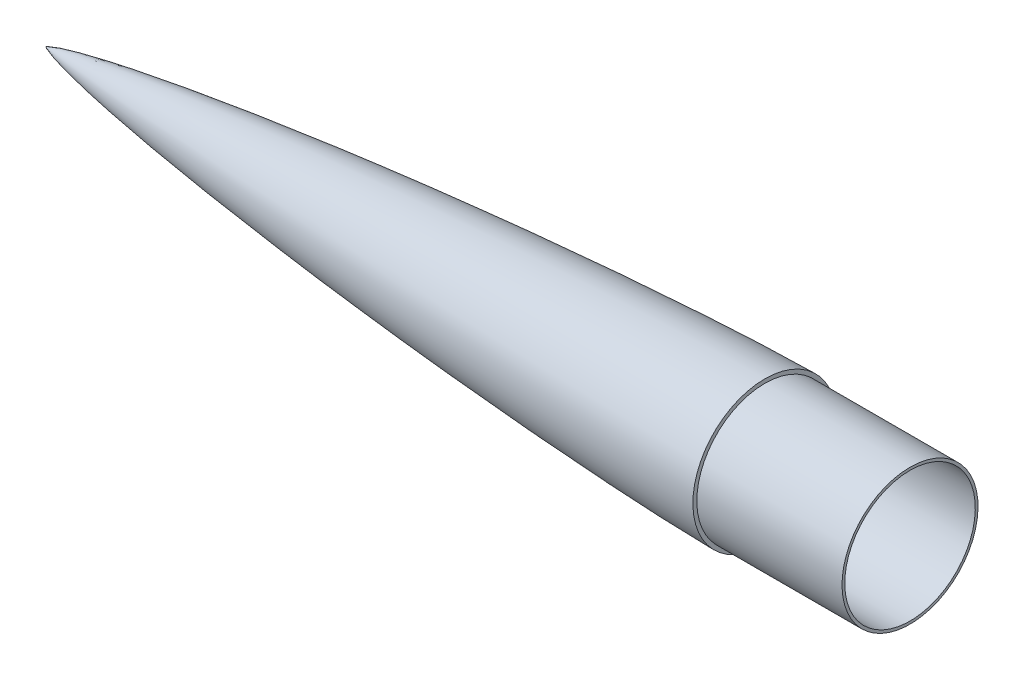
ISO-10303-21;
HEADER;
FILE_DESCRIPTION(('STEP AP214'),'2;1');
FILE_NAME('part.step','',(''),(''),'','','');
FILE_SCHEMA(('AUTOMOTIVE_DESIGN { 1 0 10303 214 1 1 1 1 }'));
ENDSEC;
DATA;
#1=APPLICATION_CONTEXT('core data for automotive mechanical design processes');
#2=APPLICATION_PROTOCOL_DEFINITION('international standard','automotive_design',2000,#1);
#3=PRODUCT_CONTEXT('',#1,'mechanical');
#4=PRODUCT('Part','Part','',(#3));
#5=PRODUCT_RELATED_PRODUCT_CATEGORY('part','',(#4));
#6=PRODUCT_DEFINITION_FORMATION('','',#4);
#7=PRODUCT_DEFINITION_CONTEXT('part definition',#1,'design');
#8=PRODUCT_DEFINITION('design','',#6,#7);
#9=PRODUCT_DEFINITION_SHAPE('','',#8);
#10=(LENGTH_UNIT() NAMED_UNIT(*) SI_UNIT(.MILLI.,.METRE.));
#11=(NAMED_UNIT(*) PLANE_ANGLE_UNIT() SI_UNIT($,.RADIAN.));
#12=(NAMED_UNIT(*) SI_UNIT($,.STERADIAN.) SOLID_ANGLE_UNIT());
#13=UNCERTAINTY_MEASURE_WITH_UNIT(LENGTH_MEASURE(1.E-05),#10,'distance_accuracy_value','');
#14=(GEOMETRIC_REPRESENTATION_CONTEXT(3) GLOBAL_UNCERTAINTY_ASSIGNED_CONTEXT((#13)) GLOBAL_UNIT_ASSIGNED_CONTEXT((#10,
#11,#12)) REPRESENTATION_CONTEXT('',''));
#15=CARTESIAN_POINT('',(0.,0.,0.));
#16=DIRECTION('',(0.,0.,1.));
#17=DIRECTION('',(1.,0.,0.));
#18=AXIS2_PLACEMENT_3D('',#15,#16,#17);
#19=CARTESIAN_POINT('',(-476.,0.,0.));
#20=CARTESIAN_POINT('',(-475.999922920819,0.000860537285582133,0.));
#21=CARTESIAN_POINT('',(-475.991878272098,0.0192033740595545,0.));
#22=CARTESIAN_POINT('',(-475.965540019143,0.0488864114918146,0.));
#23=CARTESIAN_POINT('',(-475.880792523819,0.123460292077126,0.));
#24=CARTESIAN_POINT('',(-475.734454887747,0.21905444991268,0.));
#25=CARTESIAN_POINT('',(-475.487969376193,0.357045715282055,0.));
#26=CARTESIAN_POINT('',(-474.946410800452,0.615798145596084,0.));
#27=CARTESIAN_POINT('',(-473.65161712361,1.12979349487069,0.));
#28=CARTESIAN_POINT('',(-471.290217834756,1.88750510020403,0.));
#29=CARTESIAN_POINT('',(-467.913404675593,2.80855324353986,0.));
#30=CARTESIAN_POINT('',(-463.57646866607,3.85126433139292,0.));
#31=CARTESIAN_POINT('',(-458.79875295069,4.89613203429191,0.));
#32=CARTESIAN_POINT('',(-452.589553113043,6.15603189866401,0.));
#33=CARTESIAN_POINT('',(-444.698966636829,7.63096789135536,0.));
#34=CARTESIAN_POINT('',(-435.267626095885,9.25753951763064,0.));
#35=CARTESIAN_POINT('',(-421.488450855965,11.4584031076222,0.));
#36=CARTESIAN_POINT('',(-404.627471311696,13.9261565228831,0.));
#37=CARTESIAN_POINT('',(-384.923327777814,16.5691784085527,0.));
#38=CARTESIAN_POINT('',(-362.372449264854,19.3405007994015,0.));
#39=CARTESIAN_POINT('',(-339.797340005275,21.9058954693206,0.));
#40=CARTESIAN_POINT('',(-317.202600233706,24.2917857189304,0.));
#41=CARTESIAN_POINT('',(-294.59135497595,26.5153367887988,0.));
#42=CARTESIAN_POINT('',(-271.96572692869,28.5872741820699,0.));
#43=CARTESIAN_POINT('',(-249.327276754401,30.5138629975586,0.));
#44=CARTESIAN_POINT('',(-226.677108608059,32.297557454107,0.));
#45=CARTESIAN_POINT('',(-206.848692738423,33.732365110092,0.));
#46=CARTESIAN_POINT('',(-189.846474353373,34.8692307241149,0.));
#47=CARTESIAN_POINT('',(-175.673789138833,35.7516294615016,0.));
#48=CARTESIAN_POINT('',(-164.33319182662,36.4169221974018,0.));
#49=CARTESIAN_POINT('',(-152.990183206642,37.039475316776,0.));
#50=CARTESIAN_POINT('',(-143.062951853194,37.5443636466366,0.));
#51=CARTESIAN_POINT('',(-134.552405593403,37.946331659794,0.));
#52=CARTESIAN_POINT('',(-127.459279753901,38.2591747384012,0.));
#53=CARTESIAN_POINT('',(-121.784158279213,38.4953770018506,0.));
#54=CARTESIAN_POINT('',(-116.817886195576,38.6889505919785,0.));
#55=CARTESIAN_POINT('',(-112.560688711536,38.8447226946378,0.));
#56=CARTESIAN_POINT('',(-108.303185391557,38.9919116655273,0.));
#57=CARTESIAN_POINT('',(-104.095299495923,39.1282694069527,0.));
#58=CARTESIAN_POINT('',(-99.2272676582076,39.2724052032418,0.));
#59=CARTESIAN_POINT('',(-94.383680395873,39.3966923715469,0.));
#60=CARTESIAN_POINT('',(-90.2744672400873,39.487225868938,0.));
#61=CARTESIAN_POINT('',(-86.8498753102338,39.5493023060781,0.));
#62=CARTESIAN_POINT('',(-84.110051575155,39.5917478078075,0.));
#63=CARTESIAN_POINT('',(-82.0550708175597,39.6119512549976,0.));
#64=CARTESIAN_POINT('',(-80.6850319967164,39.624,0.));
#65=CARTESIAN_POINT('',(-80.,39.624,0.));
#66=B_SPLINE_CURVE_WITH_KNOTS('',4,(#19,#20,#21,#22,#23,#24,#25,#26,#27,#28,#29,#30,#31,#32,#33,
#34,#35,#36,#37,#38,#39,#40,#41,#42,#43,#44,#45,#46,#47,#48,#49,#50,#51,#52,#53,#54,#55,#56,#57,
#58,#59,#60,#61,#62,#63,#64,#65),.UNSPECIFIED.,.F.,.F.,(5,1,1,1,1,1,1,1,1,1,1,1,1,1,1,1,1,1,1,1,
1,1,1,1,1,1,1,1,1,1,1,1,1,1,1,1,1,1,1,1,1,1,1,5),(0.,8.46137496915254E-06,0.000200286876665194,
0.000392112378361236,0.00113211775397311,0.0017563677667984,0.00303421072244488,
0.00640971949606964,0.0150998058776097,0.0266230205864183,0.038146235295227,0.0511565939920489,
0.0641669526888709,0.0901876700825147,0.118681938881245,0.147176207679975,0.204164770614627,
0.261153320075333,0.318141952183594,0.375130483161684,0.432119004427054,0.489107554987305,
0.546096106691865,0.60308464607117,0.660073112282482,0.717061773396178,0.745556055281515,
0.774050337166852,0.802544605718784,0.831038874270717,0.859532973799257,0.873780023563527,
0.888027073327797,0.902274269448877,0.916521465569957,0.923645063630497,0.930768661691037,
0.945015857812117,0.958761893359088,0.972507928906058,0.979380946679544,0.986253964453029,
0.993126982226515,1.),.UNSPECIFIED.);
#67=CARTESIAN_POINT('',(-472.22363793767,0.,0.));
#68=DIRECTION('',(1.,0.,0.));
#69=AXIS1_PLACEMENT('',#67,#68);
#70=SURFACE_OF_REVOLUTION('',#66,#69);
#71=CARTESIAN_POINT('',(-80.,0.,0.));
#72=DIRECTION('',(1.,0.,0.));
#73=DIRECTION('',(0.,1.,0.));
#74=AXIS2_PLACEMENT_3D('',#71,#72,#73);
#75=CIRCLE('',#74,39.624);
#76=CARTESIAN_POINT('',(-80.,39.624,0.));
#77=VERTEX_POINT('',#76);
#78=EDGE_CURVE('E72',#77,#77,#75,.T.);
#79=ORIENTED_EDGE('',*,*,#78,.F.);
#80=EDGE_LOOP('',(#79));
#81=FACE_BOUND('',#80,.T.);
#82=CARTESIAN_POINT('',(-476.,0.,0.));
#83=VERTEX_POINT('',#82);
#84=VERTEX_LOOP('',#83);
#85=FACE_BOUND('',#84,.T.);
#86=ADVANCED_FACE('F47',(#81,#85),#70,.T.);
#87=CARTESIAN_POINT('',(-80.,-2062.95955382398,0.));
#88=DIRECTION('',(0.,0.,-1.));
#89=DIRECTION('',(0.,1.,0.));
#90=AXIS2_PLACEMENT_3D('',#87,#88,#89);
#91=CIRCLE('',#90,2099.91464180588);
#92=TRIMMED_CURVE('',#91,(PARAMETER_VALUE(-0.18788420377906)),
(PARAMETER_VALUE(0.18788420377906)),.T.,.PARAMETER.);
#93=CARTESIAN_POINT('',(-80.,0.,0.));
#94=DIRECTION('',(1.,0.,0.));
#95=AXIS1_PLACEMENT('',#93,#94);
#96=SURFACE_OF_REVOLUTION('',#92,#95);
#97=CARTESIAN_POINT('',(-144.476509098287,0.,0.));
#98=DIRECTION('',(1.,0.,0.));
#99=DIRECTION('',(0.,1.,0.));
#100=AXIS2_PLACEMENT_3D('',#97,#98,#99);
#101=CIRCLE('',#100,35.965);
#102=CARTESIAN_POINT('',(-144.476509098287,35.965,0.));
#103=VERTEX_POINT('',#102);
#104=EDGE_CURVE('E11',#103,#103,#101,.T.);
#105=ORIENTED_EDGE('',*,*,#104,.T.);
#106=EDGE_LOOP('',(#105));
#107=FACE_BOUND('',#106,.T.);
#108=CARTESIAN_POINT('',(-472.22363793767,0.,0.));
#109=VERTEX_POINT('',#108);
#110=VERTEX_LOOP('',#109);
#111=FACE_BOUND('',#110,.T.);
#112=ADVANCED_FACE('F63',(#107,#111),#96,.F.);
#113=CARTESIAN_POINT('',(-472.22363793767,0.,0.));
#114=DIRECTION('',(1.,0.,0.));
#115=DIRECTION('',(0.,1.,0.));
#116=AXIS2_PLACEMENT_3D('',#113,#114,#115);
#117=CYLINDRICAL_SURFACE('',#116,35.965);
#118=ORIENTED_EDGE('',*,*,#104,.F.);
#119=EDGE_LOOP('',(#118));
#120=FACE_BOUND('',#119,.T.);
#121=CARTESIAN_POINT('',(0.,0.,0.));
#122=DIRECTION('',(1.,0.,0.));
#123=DIRECTION('',(0.,1.,0.));
#124=AXIS2_PLACEMENT_3D('',#121,#122,#123);
#125=CIRCLE('',#124,35.965);
#126=CARTESIAN_POINT('',(0.,35.965,0.));
#127=VERTEX_POINT('',#126);
#128=EDGE_CURVE('E56',#127,#127,#125,.T.);
#129=ORIENTED_EDGE('',*,*,#128,.T.);
#130=EDGE_LOOP('',(#129));
#131=FACE_BOUND('',#130,.T.);
#132=ADVANCED_FACE('F68',(#120,#131),#117,.F.);
#133=CARTESIAN_POINT('',(0.,0.,0.));
#134=DIRECTION('',(1.,0.,0.));
#135=DIRECTION('',(0.,1.,0.));
#136=AXIS2_PLACEMENT_3D('',#133,#134,#135);
#137=PLANE('',#136);
#138=CARTESIAN_POINT('',(0.,0.,0.));
#139=DIRECTION('',(1.,0.,0.));
#140=DIRECTION('',(0.,1.,0.));
#141=AXIS2_PLACEMENT_3D('',#138,#139,#140);
#142=CIRCLE('',#141,37.465);
#143=CARTESIAN_POINT('',(0.,37.465,0.));
#144=VERTEX_POINT('',#143);
#145=EDGE_CURVE('E79',#144,#144,#142,.T.);
#146=ORIENTED_EDGE('',*,*,#145,.T.);
#147=EDGE_LOOP('',(#146));
#148=FACE_BOUND('',#147,.T.);
#149=ORIENTED_EDGE('',*,*,#128,.F.);
#150=EDGE_LOOP('',(#149));
#151=FACE_BOUND('',#150,.T.);
#152=ADVANCED_FACE('F92',(#148,#151),#137,.T.);
#153=CARTESIAN_POINT('',(-472.22363793767,0.,0.));
#154=DIRECTION('',(1.,0.,0.));
#155=DIRECTION('',(0.,1.,0.));
#156=AXIS2_PLACEMENT_3D('',#153,#154,#155);
#157=CYLINDRICAL_SURFACE('',#156,37.465);
#158=CARTESIAN_POINT('',(-80.,0.,0.));
#159=DIRECTION('',(1.,0.,0.));
#160=DIRECTION('',(0.,1.,0.));
#161=AXIS2_PLACEMENT_3D('',#158,#159,#160);
#162=CIRCLE('',#161,37.465);
#163=CARTESIAN_POINT('',(-80.,37.465,0.));
#164=VERTEX_POINT('',#163);
#165=EDGE_CURVE('E75',#164,#164,#162,.T.);
#166=ORIENTED_EDGE('',*,*,#165,.T.);
#167=EDGE_LOOP('',(#166));
#168=FACE_BOUND('',#167,.T.);
#169=ORIENTED_EDGE('',*,*,#145,.F.);
#170=EDGE_LOOP('',(#169));
#171=FACE_BOUND('',#170,.T.);
#172=ADVANCED_FACE('F94',(#168,#171),#157,.T.);
#173=CARTESIAN_POINT('',(-80.,-5.14230210572095E-13,0.));
#174=DIRECTION('',(1.,0.,0.));
#175=DIRECTION('',(0.,1.,0.));
#176=AXIS2_PLACEMENT_3D('',#173,#174,#175);
#177=PLANE('',#176);
#178=ORIENTED_EDGE('',*,*,#78,.T.);
#179=EDGE_LOOP('',(#178));
#180=FACE_BOUND('',#179,.T.);
#181=ORIENTED_EDGE('',*,*,#165,.F.);
#182=EDGE_LOOP('',(#181));
#183=FACE_BOUND('',#182,.T.);
#184=ADVANCED_FACE('F101',(#180,#183),#177,.T.);
#185=CLOSED_SHELL('',(#86,#112,#132,#152,#172,#184));
#186=MANIFOLD_SOLID_BREP('B2',#185);
#187=ADVANCED_BREP_SHAPE_REPRESENTATION('',(#18,#186),#14);
#188=SHAPE_DEFINITION_REPRESENTATION(#9,#187);
ENDSEC;
END-ISO-10303-21;
